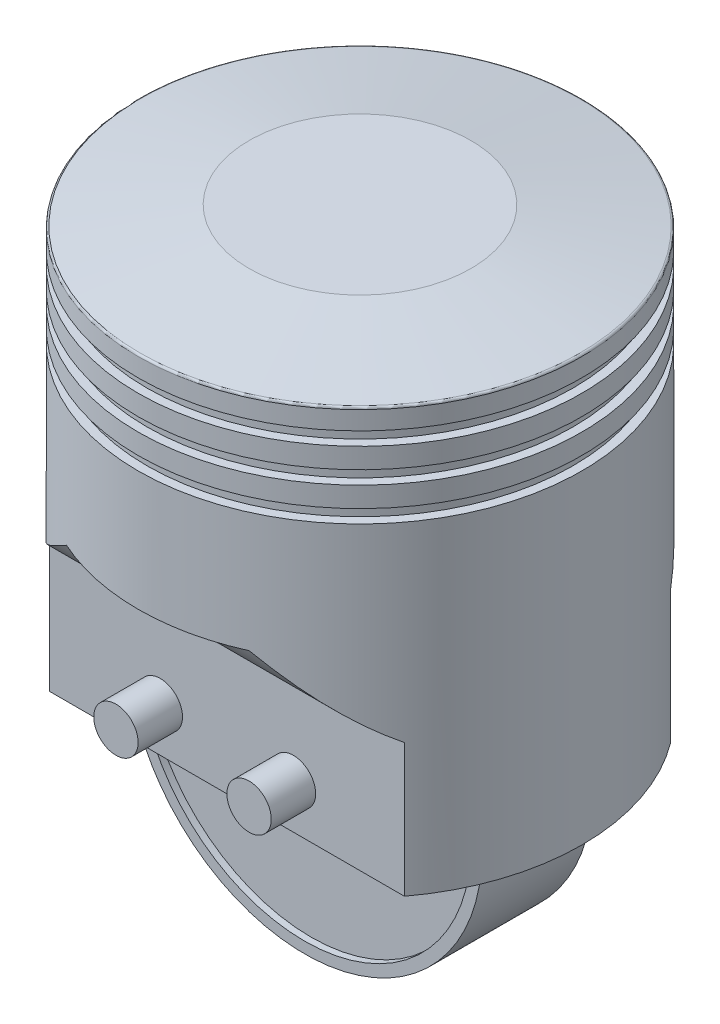
ISO-10303-21;
HEADER;
FILE_DESCRIPTION(('STEP AP214'),'2;1');
FILE_NAME('part.step','',(''),(''),'','','');
FILE_SCHEMA(('AUTOMOTIVE_DESIGN { 1 0 10303 214 1 1 1 1 }'));
ENDSEC;
DATA;
#1=APPLICATION_CONTEXT('core data for automotive mechanical design processes');
#2=APPLICATION_PROTOCOL_DEFINITION('international standard','automotive_design',2000,#1);
#3=PRODUCT_CONTEXT('',#1,'mechanical');
#4=PRODUCT('Part','Part','',(#3));
#5=PRODUCT_RELATED_PRODUCT_CATEGORY('part','',(#4));
#6=PRODUCT_DEFINITION_FORMATION('','',#4);
#7=PRODUCT_DEFINITION_CONTEXT('part definition',#1,'design');
#8=PRODUCT_DEFINITION('design','',#6,#7);
#9=PRODUCT_DEFINITION_SHAPE('','',#8);
#10=(LENGTH_UNIT() NAMED_UNIT(*) SI_UNIT(.MILLI.,.METRE.));
#11=(NAMED_UNIT(*) PLANE_ANGLE_UNIT() SI_UNIT($,.RADIAN.));
#12=(NAMED_UNIT(*) SI_UNIT($,.STERADIAN.) SOLID_ANGLE_UNIT());
#13=UNCERTAINTY_MEASURE_WITH_UNIT(LENGTH_MEASURE(1.E-05),#10,'distance_accuracy_value','');
#14=(GEOMETRIC_REPRESENTATION_CONTEXT(3) GLOBAL_UNCERTAINTY_ASSIGNED_CONTEXT((#13)) GLOBAL_UNIT_ASSIGNED_CONTEXT((#10,
#11,#12)) REPRESENTATION_CONTEXT('',''));
#15=CARTESIAN_POINT('',(0.,0.,0.));
#16=DIRECTION('',(0.,0.,1.));
#17=DIRECTION('',(1.,0.,0.));
#18=AXIS2_PLACEMENT_3D('',#15,#16,#17);
#19=CARTESIAN_POINT('',(0.,0.,-12.5));
#20=DIRECTION('',(0.,0.,1.));
#21=DIRECTION('',(1.,0.,0.));
#22=AXIS2_PLACEMENT_3D('',#19,#20,#21);
#23=CYLINDRICAL_SURFACE('',#22,37.5);
#24=CARTESIAN_POINT('',(0.,0.,-11.));
#25=DIRECTION('',(0.,0.,1.));
#26=DIRECTION('',(1.,0.,0.));
#27=AXIS2_PLACEMENT_3D('',#24,#25,#26);
#28=CIRCLE('',#27,37.5);
#29=CARTESIAN_POINT('',(-37.4165738677394,-2.5,-11.));
#30=VERTEX_POINT('',#29);
#31=CARTESIAN_POINT('',(37.4165738677394,-2.5,-11.));
#32=VERTEX_POINT('',#31);
#33=EDGE_CURVE('E76',#30,#32,#28,.T.);
#34=ORIENTED_EDGE('',*,*,#33,.T.);
#35=DIRECTION('',(0.,0.,1.));
#36=VECTOR('',#35,1.);
#37=CARTESIAN_POINT('',(37.4165738677394,-2.5,-12.5));
#38=LINE('',#37,#36);
#39=CARTESIAN_POINT('',(37.4165738677394,-2.5,-12.5));
#40=VERTEX_POINT('',#39);
#41=EDGE_CURVE('E158',#40,#32,#38,.T.);
#42=ORIENTED_EDGE('',*,*,#41,.F.);
#43=CARTESIAN_POINT('',(0.,0.,-12.5));
#44=DIRECTION('',(0.,0.,1.));
#45=DIRECTION('',(1.,0.,0.));
#46=AXIS2_PLACEMENT_3D('',#43,#44,#45);
#47=CIRCLE('',#46,37.5);
#48=CARTESIAN_POINT('',(-37.4165738677394,-2.5,-12.5));
#49=VERTEX_POINT('',#48);
#50=EDGE_CURVE('E185',#49,#40,#47,.T.);
#51=ORIENTED_EDGE('',*,*,#50,.F.);
#52=DIRECTION('',(0.,0.,1.));
#53=VECTOR('',#52,1.);
#54=CARTESIAN_POINT('',(-37.4165738677394,-2.5,-12.5));
#55=LINE('',#54,#53);
#56=EDGE_CURVE('E157',#49,#30,#55,.T.);
#57=ORIENTED_EDGE('',*,*,#56,.T.);
#58=EDGE_LOOP('',(#34,#42,#51,#57));
#59=FACE_BOUND('',#58,.T.);
#60=ADVANCED_FACE('F62',(#59),#23,.F.);
#61=CARTESIAN_POINT('',(-37.4165738677394,-2.5,-12.5));
#62=DIRECTION('',(0.,-1.,0.));
#63=DIRECTION('',(0.,0.,-1.));
#64=AXIS2_PLACEMENT_3D('',#61,#62,#63);
#65=PLANE('',#64);
#66=ORIENTED_EDGE('',*,*,#41,.T.);
#67=DIRECTION('',(1.,0.,0.));
#68=VECTOR('',#67,1.);
#69=CARTESIAN_POINT('',(-37.4165738677394,-2.5,-11.));
#70=LINE('',#69,#68);
#71=EDGE_CURVE('E165',#30,#32,#70,.T.);
#72=ORIENTED_EDGE('',*,*,#71,.F.);
#73=ORIENTED_EDGE('',*,*,#56,.F.);
#74=DIRECTION('',(1.,0.,0.));
#75=VECTOR('',#74,1.);
#76=CARTESIAN_POINT('',(-37.4165738677394,-2.5,-12.5));
#77=LINE('',#76,#75);
#78=EDGE_CURVE('E188',#49,#40,#77,.T.);
#79=ORIENTED_EDGE('',*,*,#78,.T.);
#80=EDGE_LOOP('',(#66,#72,#73,#79));
#81=FACE_BOUND('',#80,.T.);
#82=ADVANCED_FACE('F348',(#81),#65,.T.);
#83=CARTESIAN_POINT('',(0.,0.,0.));
#84=DIRECTION('',(0.,1.,0.));
#85=DIRECTION('',(0.,0.,1.));
#86=AXIS2_PLACEMENT_3D('',#83,#84,#85);
#87=PLANE('',#86);
#88=CARTESIAN_POINT('',(0.,0.,0.));
#89=DIRECTION('',(0.,1.,0.));
#90=DIRECTION('',(0.,0.,1.));
#91=AXIS2_PLACEMENT_3D('',#88,#89,#90);
#92=CIRCLE('',#91,50.);
#93=CARTESIAN_POINT('',(40.,0.,30.));
#94=VERTEX_POINT('',#93);
#95=CARTESIAN_POINT('',(40.,0.,-30.));
#96=VERTEX_POINT('',#95);
#97=EDGE_CURVE('E230',#94,#96,#92,.T.);
#98=ORIENTED_EDGE('',*,*,#97,.F.);
#99=DIRECTION('',(1.,0.,0.));
#100=VECTOR('',#99,1.);
#101=CARTESIAN_POINT('',(-50.,0.,30.));
#102=LINE('',#101,#100);
#103=CARTESIAN_POINT('',(-40.,0.,30.));
#104=VERTEX_POINT('',#103);
#105=EDGE_CURVE('E209',#104,#94,#102,.T.);
#106=ORIENTED_EDGE('',*,*,#105,.F.);
#107=CARTESIAN_POINT('',(-40.,0.,-30.));
#108=VERTEX_POINT('',#107);
#109=EDGE_CURVE('E227',#108,#104,#92,.T.);
#110=ORIENTED_EDGE('',*,*,#109,.F.);
#111=DIRECTION('',(1.,0.,0.));
#112=VECTOR('',#111,1.);
#113=CARTESIAN_POINT('',(-50.,0.,-30.));
#114=LINE('',#113,#112);
#115=EDGE_CURVE('E202',#108,#96,#114,.T.);
#116=ORIENTED_EDGE('',*,*,#115,.T.);
#117=EDGE_LOOP('',(#98,#106,#110,#116));
#118=FACE_BOUND('',#117,.T.);
#119=DIRECTION('',(1.,0.,0.));
#120=VECTOR('',#119,1.);
#121=CARTESIAN_POINT('',(-40.,0.,-12.5));
#122=LINE('',#121,#120);
#123=CARTESIAN_POINT('',(-40.,0.,-12.5));
#124=VERTEX_POINT('',#123);
#125=CARTESIAN_POINT('',(40.,0.,-12.5));
#126=VERTEX_POINT('',#125);
#127=EDGE_CURVE('E196',#124,#126,#122,.T.);
#128=ORIENTED_EDGE('',*,*,#127,.F.);
#129=DIRECTION('',(0.,0.,1.));
#130=VECTOR('',#129,1.);
#131=CARTESIAN_POINT('',(-40.,0.,-12.5));
#132=LINE('',#131,#130);
#133=CARTESIAN_POINT('',(-40.,0.,12.5));
#134=VERTEX_POINT('',#133);
#135=EDGE_CURVE('E199',#124,#134,#132,.T.);
#136=ORIENTED_EDGE('',*,*,#135,.T.);
#137=DIRECTION('',(1.,0.,0.));
#138=VECTOR('',#137,1.);
#139=CARTESIAN_POINT('',(-40.,0.,12.5));
#140=LINE('',#139,#138);
#141=CARTESIAN_POINT('',(40.,0.,12.5));
#142=VERTEX_POINT('',#141);
#143=EDGE_CURVE('E182',#134,#142,#140,.T.);
#144=ORIENTED_EDGE('',*,*,#143,.T.);
#145=DIRECTION('',(0.,0.,1.));
#146=VECTOR('',#145,1.);
#147=CARTESIAN_POINT('',(40.,0.,-12.5));
#148=LINE('',#147,#146);
#149=EDGE_CURVE('E198',#126,#142,#148,.T.);
#150=ORIENTED_EDGE('',*,*,#149,.F.);
#151=EDGE_LOOP('',(#128,#136,#144,#150));
#152=FACE_BOUND('',#151,.T.);
#153=ADVANCED_FACE('F393',(#118,#152),#87,.F.);
#154=CARTESIAN_POINT('',(0.,95.74,0.));
#155=DIRECTION('',(0.,1.,0.));
#156=DIRECTION('',(0.,0.,1.));
#157=AXIS2_PLACEMENT_3D('',#154,#155,#156);
#158=CYLINDRICAL_SURFACE('',#157,50.);
#159=ORIENTED_EDGE('',*,*,#109,.T.);
#160=DIRECTION('',(0.,1.,0.));
#161=VECTOR('',#160,1.);
#162=CARTESIAN_POINT('',(-40.,95.74,30.));
#163=LINE('',#162,#161);
#164=CARTESIAN_POINT('',(-40.,30.,30.));
#165=VERTEX_POINT('',#164);
#166=EDGE_CURVE('E691',#104,#165,#163,.T.);
#167=ORIENTED_EDGE('',*,*,#166,.T.);
#168=CARTESIAN_POINT('',(-40.,30.,30.));
#169=CARTESIAN_POINT('',(-39.4227032689949,30.4975534975394,30.7696701134222));
#170=CARTESIAN_POINT('',(-38.8280758665105,31.0101840720913,31.5162848137399));
#171=CARTESIAN_POINT('',(-37.6072571229905,32.0613492886964,32.9634784476577));
#172=CARTESIAN_POINT('',(-36.981078392916,32.599873577243,33.6640755204339));
#173=CARTESIAN_POINT('',(-35.7005169530153,33.6983552946373,35.0191516853208));
#174=CARTESIAN_POINT('',(-35.0461669614549,34.2582877795347,35.6736820686269));
#175=CARTESIAN_POINT('',(-33.7107707573544,35.396454228156,36.9381869030231));
#176=CARTESIAN_POINT('',(-33.0297220443191,35.9746899051022,37.5481571653982));
#177=CARTESIAN_POINT('',(-31.6559925614159,37.1345691402128,38.7129641596555));
#178=CARTESIAN_POINT('',(-30.9637813965993,37.7159373527949,39.2686305548842));
#179=CARTESIAN_POINT('',(-29.5566072080388,38.8892481654038,40.3384204088622));
#180=CARTESIAN_POINT('',(-28.8416439271136,39.4811908849277,40.8525433977879));
#181=CARTESIAN_POINT('',(-27.3898803244225,40.6718354566004,41.839751771623));
#182=CARTESIAN_POINT('',(-26.6530867701786,41.2705351791315,42.3128496996117));
#183=CARTESIAN_POINT('',(-25.1576181666023,42.4708742234107,43.2187284102895));
#184=CARTESIAN_POINT('',(-24.3989466769569,43.072513053862,43.6515157038571));
#185=CARTESIAN_POINT('',(-23.3798733469499,43.8677498266828,44.1979794501996));
#186=CARTESIAN_POINT('',(-23.1295196711872,44.0621076531451,44.3295087284819));
#187=CARTESIAN_POINT('',(-22.6264493222155,44.4504360746419,44.5883820555464));
#188=CARTESIAN_POINT('',(-22.3737331496249,44.6444067415986,44.7157269662917));
#189=CARTESIAN_POINT('',(-21.8650471727875,45.0324183037877,44.9666587982457));
#190=CARTESIAN_POINT('',(-21.6090696460871,45.2264575086261,45.0902326700021));
#191=CARTESIAN_POINT('',(-21.0945225142599,45.6138252212219,45.3332334026729));
#192=CARTESIAN_POINT('',(-20.8359523648707,45.8071535675945,45.4526593683017));
#193=CARTESIAN_POINT('',(-20.5760807735584,46.,45.57));
#194=B_SPLINE_CURVE_WITH_KNOTS('',3,(#168,#169,#170,#171,#172,#173,#174,#175,#176,#177,#178,
#179,#180,#181,#182,#183,#184,#185,#186,#187,#188,#189,#190,#191,#192,#193),.UNSPECIFIED.,.F.,
.F.,(4,2,2,2,2,2,2,2,2,2,2,2,4),(0.,3.24865454866567,6.49602076477623,9.73971217259787,
12.9837081007362,16.1658316923563,19.3479912662757,22.5291744649436,25.709842952158,
26.7392718324943,27.7684873079119,28.800933118737,29.8336004054466),.UNSPECIFIED.);
#195=CARTESIAN_POINT('',(-20.5760807735584,46.,45.57));
#196=VERTEX_POINT('',#195);
#197=EDGE_CURVE('E315',#165,#196,#194,.T.);
#198=ORIENTED_EDGE('',*,*,#197,.T.);
#199=CARTESIAN_POINT('',(0.,46.,0.));
#200=DIRECTION('',(0.,1.,0.));
#201=DIRECTION('',(0.,0.,1.));
#202=AXIS2_PLACEMENT_3D('',#199,#200,#201);
#203=CIRCLE('',#202,50.);
#204=CARTESIAN_POINT('',(20.5760807735584,46.,45.57));
#205=VERTEX_POINT('',#204);
#206=EDGE_CURVE('E306',#196,#205,#203,.T.);
#207=ORIENTED_EDGE('',*,*,#206,.T.);
#208=CARTESIAN_POINT('',(20.5760807735584,46.,45.57));
#209=CARTESIAN_POINT('',(20.981784040253,45.6989144606753,45.3868047922138));
#210=CARTESIAN_POINT('',(21.3843295908557,45.396674988717,45.198531029963));
#211=CARTESIAN_POINT('',(22.183314755004,44.790649637896,44.8118037442421));
#212=CARTESIAN_POINT('',(22.5797544249881,44.4868637733618,44.6133503149392));
#213=CARTESIAN_POINT('',(23.3667819328865,43.8784728089327,44.2062184562751));
#214=CARTESIAN_POINT('',(23.7573692153487,43.5738676344726,43.9975390642909));
#215=CARTESIAN_POINT('',(24.5327756890314,42.964524273275,43.5699315233433));
#216=CARTESIAN_POINT('',(24.9175948619762,42.6597860861192,43.3510033419164));
#217=CARTESIAN_POINT('',(26.0657605722335,41.7445125045882,42.6774574997543));
#218=CARTESIAN_POINT('',(26.8205771463097,41.1346561038182,42.2072361006545));
#219=CARTESIAN_POINT('',(28.3074500316953,39.9211891251853,41.2247758593004));
#220=CARTESIAN_POINT('',(29.0395072978727,39.3175782860004,40.7125387831054));
#221=CARTESIAN_POINT('',(30.4638796376346,38.1340907109363,39.6575263273948));
#222=CARTESIAN_POINT('',(31.1567207061469,37.5539868769227,39.1157171393662));
#223=CARTESIAN_POINT('',(32.5191898661321,36.4067448258019,37.9905628434812));
#224=CARTESIAN_POINT('',(33.1888163459033,35.8396075098385,37.4072148602942));
#225=CARTESIAN_POINT('',(34.5022607121716,34.7225940370902,36.1992936055282));
#226=CARTESIAN_POINT('',(35.1461167971835,34.1726926161163,35.574785279314));
#227=CARTESIAN_POINT('',(36.4070455086904,33.0927699150074,34.2832490773174));
#228=CARTESIAN_POINT('',(37.0241253362605,32.5627432951151,33.6162327540551));
#229=CARTESIAN_POINT('',(37.8310058369131,31.8686291724948,32.6942093961392));
#230=CARTESIAN_POINT('',(38.0337293737554,31.6941439259334,32.4581688983703));
#231=CARTESIAN_POINT('',(38.4357168337174,31.3480169315365,31.9811343002584));
#232=CARTESIAN_POINT('',(38.63498100088,31.1763749831584,31.7401405519861));
#233=CARTESIAN_POINT('',(39.0307114624784,30.8354186902669,31.2522416515386));
#234=CARTESIAN_POINT('',(39.2271639925751,30.6661158839892,31.0053172761714));
#235=CARTESIAN_POINT('',(39.6163815654185,30.3306561591055,30.5064322018367));
#236=CARTESIAN_POINT('',(39.8091462859388,30.164499515412,30.2544710666745));
#237=CARTESIAN_POINT('',(40.,30.,30.));
#238=B_SPLINE_CURVE_WITH_KNOTS('',3,(#208,#209,#210,#211,#212,#213,#214,#215,#216,#217,#218,
#219,#220,#221,#222,#223,#224,#225,#226,#227,#228,#229,#230,#231,#232,#233,#234,#235,#236,#237),
.UNSPECIFIED.,.F.,.F.,(4,2,2,2,2,2,2,2,2,2,2,2,2,2,4),(0.,1.61218211852802,3.22434932622676,
4.83666858822806,6.44899295765845,9.68281694015645,12.9165050638105,16.0762470331502,
19.236207933993,22.3912969899199,25.5455322050653,26.615682814609,27.6857576204987,
28.7599618277761,29.8342594700834),.UNSPECIFIED.);
#239=CARTESIAN_POINT('',(40.,30.,30.));
#240=VERTEX_POINT('',#239);
#241=EDGE_CURVE('E308',#205,#240,#238,.T.);
#242=ORIENTED_EDGE('',*,*,#241,.T.);
#243=DIRECTION('',(0.,1.,0.));
#244=VECTOR('',#243,1.);
#245=CARTESIAN_POINT('',(40.,95.74,30.));
#246=LINE('',#245,#244);
#247=EDGE_CURVE('E689',#240,#94,#246,.F.);
#248=ORIENTED_EDGE('',*,*,#247,.T.);
#249=ORIENTED_EDGE('',*,*,#97,.T.);
#250=DIRECTION('',(0.,1.,0.));
#251=VECTOR('',#250,1.);
#252=CARTESIAN_POINT('',(40.,95.74,-30.));
#253=LINE('',#252,#251);
#254=CARTESIAN_POINT('',(40.,30.,-30.));
#255=VERTEX_POINT('',#254);
#256=EDGE_CURVE('E304',#255,#96,#253,.F.);
#257=ORIENTED_EDGE('',*,*,#256,.F.);
#258=CARTESIAN_POINT('',(20.5760807735584,46.,-45.57));
#259=CARTESIAN_POINT('',(20.981784040253,45.6989144606753,-45.3868047922138));
#260=CARTESIAN_POINT('',(21.3843295908557,45.396674988717,-45.198531029963));
#261=CARTESIAN_POINT('',(22.183314755004,44.790649637896,-44.8118037442421));
#262=CARTESIAN_POINT('',(22.5797544249881,44.4868637733618,-44.6133503149392));
#263=CARTESIAN_POINT('',(23.3667819328865,43.8784728089326,-44.2062184562751));
#264=CARTESIAN_POINT('',(23.7573692153487,43.5738676344725,-43.9975390642909));
#265=CARTESIAN_POINT('',(24.5327756890314,42.9645242732749,-43.5699315233433));
#266=CARTESIAN_POINT('',(24.9175948619762,42.6597860861192,-43.3510033419164));
#267=CARTESIAN_POINT('',(26.0657605722335,41.7445125045882,-42.6774574997543));
#268=CARTESIAN_POINT('',(26.8205771463097,41.1346561038181,-42.2072361006545));
#269=CARTESIAN_POINT('',(28.3074500316953,39.9211891251853,-41.2247758593004));
#270=CARTESIAN_POINT('',(29.0395072978727,39.3175782860004,-40.7125387831054));
#271=CARTESIAN_POINT('',(30.4638796376346,38.1340907109363,-39.6575263273948));
#272=CARTESIAN_POINT('',(31.1567207061469,37.5539868769227,-39.1157171393662));
#273=CARTESIAN_POINT('',(32.5191898661322,36.4067448258019,-37.9905628434812));
#274=CARTESIAN_POINT('',(33.1888163459033,35.8396075098385,-37.4072148602942));
#275=CARTESIAN_POINT('',(34.5022607121716,34.7225940370902,-36.1992936055282));
#276=CARTESIAN_POINT('',(35.1461167971835,34.1726926161163,-35.574785279314));
#277=CARTESIAN_POINT('',(36.4070455086904,33.0927699150074,-34.2832490773173));
#278=CARTESIAN_POINT('',(37.0241253362605,32.5627432951151,-33.6162327540551));
#279=CARTESIAN_POINT('',(37.8310058369131,31.8686291724948,-32.6942093961392));
#280=CARTESIAN_POINT('',(38.0337293737554,31.6941439259334,-32.4581688983703));
#281=CARTESIAN_POINT('',(38.4357168337174,31.3480169315365,-31.9811343002584));
#282=CARTESIAN_POINT('',(38.63498100088,31.1763749831584,-31.7401405519861));
#283=CARTESIAN_POINT('',(39.0307114624784,30.8354186902669,-31.2522416515386));
#284=CARTESIAN_POINT('',(39.2271639925751,30.6661158839891,-31.0053172761713));
#285=CARTESIAN_POINT('',(39.6163815654186,30.3306561591055,-30.5064322018367));
#286=CARTESIAN_POINT('',(39.8091462859388,30.164499515412,-30.2544710666745));
#287=CARTESIAN_POINT('',(40.,30.,-30.));
#288=B_SPLINE_CURVE_WITH_KNOTS('',3,(#258,#259,#260,#261,#262,#263,#264,#265,#266,#267,#268,
#269,#270,#271,#272,#273,#274,#275,#276,#277,#278,#279,#280,#281,#282,#283,#284,#285,#286,#287),
.UNSPECIFIED.,.F.,.F.,(4,2,2,2,2,2,2,2,2,2,2,2,2,2,4),(0.,1.61218211852802,3.22434932622676,
4.83666858822805,6.44899295765844,9.68281694015645,12.9165050638105,16.0762470331502,
19.236207933993,22.3912969899199,25.5455322050652,26.615682814609,27.6857576204987,
28.7599618277761,29.8342594700834),.UNSPECIFIED.);
#289=CARTESIAN_POINT('',(20.5760807735584,46.,-45.57));
#290=VERTEX_POINT('',#289);
#291=EDGE_CURVE('E298',#290,#255,#288,.T.);
#292=ORIENTED_EDGE('',*,*,#291,.F.);
#293=CARTESIAN_POINT('',(0.,46.,0.));
#294=DIRECTION('',(0.,-1.,0.));
#295=DIRECTION('',(0.,0.,-1.));
#296=AXIS2_PLACEMENT_3D('',#293,#294,#295);
#297=CIRCLE('',#296,50.);
#298=CARTESIAN_POINT('',(-20.5760807735584,46.,-45.57));
#299=VERTEX_POINT('',#298);
#300=EDGE_CURVE('E270',#299,#290,#297,.T.);
#301=ORIENTED_EDGE('',*,*,#300,.F.);
#302=CARTESIAN_POINT('',(-40.,30.,-30.));
#303=CARTESIAN_POINT('',(-39.4227032689949,30.4975534975394,-30.7696701134222));
#304=CARTESIAN_POINT('',(-38.8280758665105,31.0101840720912,-31.5162848137399));
#305=CARTESIAN_POINT('',(-37.6072571229905,32.0613492886964,-32.9634784476577));
#306=CARTESIAN_POINT('',(-36.981078392916,32.5998735772429,-33.6640755204339));
#307=CARTESIAN_POINT('',(-35.7005169530153,33.6983552946373,-35.0191516853208));
#308=CARTESIAN_POINT('',(-35.0461669614549,34.2582877795346,-35.6736820686269));
#309=CARTESIAN_POINT('',(-33.7107707573544,35.3964542281559,-36.9381869030231));
#310=CARTESIAN_POINT('',(-33.0297220443191,35.9746899051022,-37.5481571653982));
#311=CARTESIAN_POINT('',(-31.6559925614159,37.1345691402128,-38.7129641596555));
#312=CARTESIAN_POINT('',(-30.9637813965993,37.7159373527949,-39.2686305548842));
#313=CARTESIAN_POINT('',(-29.5566072080388,38.8892481654038,-40.3384204088622));
#314=CARTESIAN_POINT('',(-28.8416439271136,39.4811908849276,-40.8525433977879));
#315=CARTESIAN_POINT('',(-27.3898803244226,40.6718354566004,-41.8397517716229));
#316=CARTESIAN_POINT('',(-26.6530867701786,41.2705351791315,-42.3128496996117));
#317=CARTESIAN_POINT('',(-25.1576181666023,42.4708742234107,-43.2187284102895));
#318=CARTESIAN_POINT('',(-24.3989466769569,43.072513053862,-43.6515157038571));
#319=CARTESIAN_POINT('',(-23.3798733469499,43.8677498266827,-44.1979794501996));
#320=CARTESIAN_POINT('',(-23.1295196711872,44.0621076531451,-44.3295087284819));
#321=CARTESIAN_POINT('',(-22.6264493222156,44.4504360746419,-44.5883820555463));
#322=CARTESIAN_POINT('',(-22.3737331496249,44.6444067415986,-44.7157269662916));
#323=CARTESIAN_POINT('',(-21.8650471727875,45.0324183037877,-44.9666587982457));
#324=CARTESIAN_POINT('',(-21.6090696460871,45.2264575086261,-45.0902326700021));
#325=CARTESIAN_POINT('',(-21.0945225142599,45.6138252212219,-45.3332334026729));
#326=CARTESIAN_POINT('',(-20.8359523648707,45.8071535675945,-45.4526593683017));
#327=CARTESIAN_POINT('',(-20.5760807735584,46.,-45.57));
#328=B_SPLINE_CURVE_WITH_KNOTS('',3,(#302,#303,#304,#305,#306,#307,#308,#309,#310,#311,#312,
#313,#314,#315,#316,#317,#318,#319,#320,#321,#322,#323,#324,#325,#326,#327),.UNSPECIFIED.,.F.,
.F.,(4,2,2,2,2,2,2,2,2,2,2,2,4),(0.,3.24865454866567,6.49602076477623,9.73971217259787,
12.9837081007362,16.1658316923563,19.3479912662757,22.5291744649436,25.709842952158,
26.7392718324943,27.7684873079119,28.800933118737,29.8336004054466),.UNSPECIFIED.);
#329=CARTESIAN_POINT('',(-40.,30.,-30.));
#330=VERTEX_POINT('',#329);
#331=EDGE_CURVE('E272',#330,#299,#328,.T.);
#332=ORIENTED_EDGE('',*,*,#331,.F.);
#333=DIRECTION('',(0.,1.,0.));
#334=VECTOR('',#333,1.);
#335=CARTESIAN_POINT('',(-40.,95.74,-30.));
#336=LINE('',#335,#334);
#337=EDGE_CURVE('E281',#108,#330,#336,.T.);
#338=ORIENTED_EDGE('',*,*,#337,.F.);
#339=EDGE_LOOP('',(#159,#167,#198,#207,#242,#248,#249,#257,#292,#301,#332,#338));
#340=FACE_BOUND('',#339,.T.);
#341=CARTESIAN_POINT('',(0.,73.,0.));
#342=DIRECTION('',(0.,1.,0.));
#343=DIRECTION('',(0.,0.,1.));
#344=AXIS2_PLACEMENT_3D('',#341,#342,#343);
#345=CIRCLE('',#344,50.);
#346=CARTESIAN_POINT('',(0.,73.,50.));
#347=VERTEX_POINT('',#346);
#348=EDGE_CURVE('E231',#347,#347,#345,.T.);
#349=ORIENTED_EDGE('',*,*,#348,.F.);
#350=EDGE_LOOP('',(#349));
#351=FACE_BOUND('',#350,.T.);
#352=ADVANCED_FACE('F283',(#340,#351),#158,.T.);
#353=CARTESIAN_POINT('',(0.,73.,0.));
#354=DIRECTION('',(0.,-1.,0.));
#355=DIRECTION('',(0.,0.,-1.));
#356=AXIS2_PLACEMENT_3D('',#353,#354,#355);
#357=PLANE('',#356);
#358=CARTESIAN_POINT('',(0.,73.,0.));
#359=DIRECTION('',(0.,1.,0.));
#360=DIRECTION('',(0.,0.,1.));
#361=AXIS2_PLACEMENT_3D('',#358,#359,#360);
#362=CIRCLE('',#361,48.);
#363=CARTESIAN_POINT('',(0.,73.,48.));
#364=VERTEX_POINT('',#363);
#365=EDGE_CURVE('E234',#364,#364,#362,.T.);
#366=ORIENTED_EDGE('',*,*,#365,.F.);
#367=EDGE_LOOP('',(#366));
#368=FACE_BOUND('',#367,.T.);
#369=ORIENTED_EDGE('',*,*,#348,.T.);
#370=EDGE_LOOP('',(#369));
#371=FACE_BOUND('',#370,.T.);
#372=ADVANCED_FACE('F410',(#368,#371),#357,.F.);
#373=CARTESIAN_POINT('',(0.,95.74,0.));
#374=DIRECTION('',(0.,1.,0.));
#375=DIRECTION('',(0.,0.,1.));
#376=AXIS2_PLACEMENT_3D('',#373,#374,#375);
#377=CYLINDRICAL_SURFACE('',#376,48.);
#378=CARTESIAN_POINT('',(0.,76.,0.));
#379=DIRECTION('',(0.,1.,0.));
#380=DIRECTION('',(0.,0.,1.));
#381=AXIS2_PLACEMENT_3D('',#378,#379,#380);
#382=CIRCLE('',#381,48.);
#383=CARTESIAN_POINT('',(0.,76.,48.));
#384=VERTEX_POINT('',#383);
#385=EDGE_CURVE('E237',#384,#384,#382,.T.);
#386=ORIENTED_EDGE('',*,*,#385,.F.);
#387=EDGE_LOOP('',(#386));
#388=FACE_BOUND('',#387,.T.);
#389=ORIENTED_EDGE('',*,*,#365,.T.);
#390=EDGE_LOOP('',(#389));
#391=FACE_BOUND('',#390,.T.);
#392=ADVANCED_FACE('F436',(#388,#391),#377,.T.);
#393=CARTESIAN_POINT('',(0.,76.,0.));
#394=DIRECTION('',(0.,-1.,0.));
#395=DIRECTION('',(0.,0.,-1.));
#396=AXIS2_PLACEMENT_3D('',#393,#394,#395);
#397=PLANE('',#396);
#398=ORIENTED_EDGE('',*,*,#385,.T.);
#399=EDGE_LOOP('',(#398));
#400=FACE_BOUND('',#399,.T.);
#401=CARTESIAN_POINT('',(0.,76.,0.));
#402=DIRECTION('',(0.,1.,0.));
#403=DIRECTION('',(0.,0.,1.));
#404=AXIS2_PLACEMENT_3D('',#401,#402,#403);
#405=CIRCLE('',#404,50.);
#406=CARTESIAN_POINT('',(0.,76.,50.));
#407=VERTEX_POINT('',#406);
#408=EDGE_CURVE('E240',#407,#407,#405,.T.);
#409=ORIENTED_EDGE('',*,*,#408,.F.);
#410=EDGE_LOOP('',(#409));
#411=FACE_BOUND('',#410,.T.);
#412=ADVANCED_FACE('F441',(#400,#411),#397,.T.);
#413=CARTESIAN_POINT('',(0.,95.74,0.));
#414=DIRECTION('',(0.,1.,0.));
#415=DIRECTION('',(0.,0.,1.));
#416=AXIS2_PLACEMENT_3D('',#413,#414,#415);
#417=CYLINDRICAL_SURFACE('',#416,50.);
#418=CARTESIAN_POINT('',(0.,80.58,0.));
#419=DIRECTION('',(0.,1.,0.));
#420=DIRECTION('',(0.,0.,1.));
#421=AXIS2_PLACEMENT_3D('',#418,#419,#420);
#422=CIRCLE('',#421,50.);
#423=CARTESIAN_POINT('',(0.,80.58,50.));
#424=VERTEX_POINT('',#423);
#425=EDGE_CURVE('E243',#424,#424,#422,.T.);
#426=ORIENTED_EDGE('',*,*,#425,.F.);
#427=EDGE_LOOP('',(#426));
#428=FACE_BOUND('',#427,.T.);
#429=ORIENTED_EDGE('',*,*,#408,.T.);
#430=EDGE_LOOP('',(#429));
#431=FACE_BOUND('',#430,.T.);
#432=ADVANCED_FACE('F449',(#428,#431),#417,.T.);
#433=CARTESIAN_POINT('',(0.,80.58,0.));
#434=DIRECTION('',(0.,-1.,0.));
#435=DIRECTION('',(0.,0.,-1.));
#436=AXIS2_PLACEMENT_3D('',#433,#434,#435);
#437=PLANE('',#436);
#438=CARTESIAN_POINT('',(0.,80.58,0.));
#439=DIRECTION('',(0.,1.,0.));
#440=DIRECTION('',(0.,0.,1.));
#441=AXIS2_PLACEMENT_3D('',#438,#439,#440);
#442=CIRCLE('',#441,48.);
#443=CARTESIAN_POINT('',(0.,80.58,48.));
#444=VERTEX_POINT('',#443);
#445=EDGE_CURVE('E246',#444,#444,#442,.T.);
#446=ORIENTED_EDGE('',*,*,#445,.F.);
#447=EDGE_LOOP('',(#446));
#448=FACE_BOUND('',#447,.T.);
#449=ORIENTED_EDGE('',*,*,#425,.T.);
#450=EDGE_LOOP('',(#449));
#451=FACE_BOUND('',#450,.T.);
#452=ADVANCED_FACE('F453',(#448,#451),#437,.F.);
#453=CARTESIAN_POINT('',(0.,95.74,0.));
#454=DIRECTION('',(0.,1.,0.));
#455=DIRECTION('',(0.,0.,1.));
#456=AXIS2_PLACEMENT_3D('',#453,#454,#455);
#457=CYLINDRICAL_SURFACE('',#456,48.);
#458=CARTESIAN_POINT('',(0.,83.58,0.));
#459=DIRECTION('',(0.,1.,0.));
#460=DIRECTION('',(0.,0.,1.));
#461=AXIS2_PLACEMENT_3D('',#458,#459,#460);
#462=CIRCLE('',#461,48.);
#463=CARTESIAN_POINT('',(0.,83.58,48.));
#464=VERTEX_POINT('',#463);
#465=EDGE_CURVE('E249',#464,#464,#462,.T.);
#466=ORIENTED_EDGE('',*,*,#465,.F.);
#467=EDGE_LOOP('',(#466));
#468=FACE_BOUND('',#467,.T.);
#469=ORIENTED_EDGE('',*,*,#445,.T.);
#470=EDGE_LOOP('',(#469));
#471=FACE_BOUND('',#470,.T.);
#472=ADVANCED_FACE('F457',(#468,#471),#457,.T.);
#473=CARTESIAN_POINT('',(0.,83.58,0.));
#474=DIRECTION('',(0.,1.,0.));
#475=DIRECTION('',(0.,0.,1.));
#476=AXIS2_PLACEMENT_3D('',#473,#474,#475);
#477=PLANE('',#476);
#478=CARTESIAN_POINT('',(0.,83.58,0.));
#479=DIRECTION('',(0.,1.,0.));
#480=DIRECTION('',(0.,0.,1.));
#481=AXIS2_PLACEMENT_3D('',#478,#479,#480);
#482=CIRCLE('',#481,50.);
#483=CARTESIAN_POINT('',(0.,83.58,50.));
#484=VERTEX_POINT('',#483);
#485=EDGE_CURVE('E252',#484,#484,#482,.T.);
#486=ORIENTED_EDGE('',*,*,#485,.F.);
#487=EDGE_LOOP('',(#486));
#488=FACE_BOUND('',#487,.T.);
#489=ORIENTED_EDGE('',*,*,#465,.T.);
#490=EDGE_LOOP('',(#489));
#491=FACE_BOUND('',#490,.T.);
#492=ADVANCED_FACE('F461',(#488,#491),#477,.F.);
#493=CARTESIAN_POINT('',(0.,95.74,0.));
#494=DIRECTION('',(0.,1.,0.));
#495=DIRECTION('',(0.,0.,1.));
#496=AXIS2_PLACEMENT_3D('',#493,#494,#495);
#497=CYLINDRICAL_SURFACE('',#496,50.);
#498=CARTESIAN_POINT('',(0.,88.16,0.));
#499=DIRECTION('',(0.,1.,0.));
#500=DIRECTION('',(0.,0.,1.));
#501=AXIS2_PLACEMENT_3D('',#498,#499,#500);
#502=CIRCLE('',#501,50.);
#503=CARTESIAN_POINT('',(0.,88.16,50.));
#504=VERTEX_POINT('',#503);
#505=EDGE_CURVE('E255',#504,#504,#502,.T.);
#506=ORIENTED_EDGE('',*,*,#505,.F.);
#507=EDGE_LOOP('',(#506));
#508=FACE_BOUND('',#507,.T.);
#509=ORIENTED_EDGE('',*,*,#485,.T.);
#510=EDGE_LOOP('',(#509));
#511=FACE_BOUND('',#510,.T.);
#512=ADVANCED_FACE('F465',(#508,#511),#497,.T.);
#513=CARTESIAN_POINT('',(0.,88.16,0.));
#514=DIRECTION('',(0.,-1.,0.));
#515=DIRECTION('',(0.,0.,-1.));
#516=AXIS2_PLACEMENT_3D('',#513,#514,#515);
#517=PLANE('',#516);
#518=CARTESIAN_POINT('',(0.,88.16,0.));
#519=DIRECTION('',(0.,1.,0.));
#520=DIRECTION('',(0.,0.,1.));
#521=AXIS2_PLACEMENT_3D('',#518,#519,#520);
#522=CIRCLE('',#521,48.);
#523=CARTESIAN_POINT('',(0.,88.16,48.));
#524=VERTEX_POINT('',#523);
#525=EDGE_CURVE('E258',#524,#524,#522,.T.);
#526=ORIENTED_EDGE('',*,*,#525,.F.);
#527=EDGE_LOOP('',(#526));
#528=FACE_BOUND('',#527,.T.);
#529=ORIENTED_EDGE('',*,*,#505,.T.);
#530=EDGE_LOOP('',(#529));
#531=FACE_BOUND('',#530,.T.);
#532=ADVANCED_FACE('F469',(#528,#531),#517,.F.);
#533=CARTESIAN_POINT('',(0.,95.74,0.));
#534=DIRECTION('',(0.,1.,0.));
#535=DIRECTION('',(0.,0.,1.));
#536=AXIS2_PLACEMENT_3D('',#533,#534,#535);
#537=CYLINDRICAL_SURFACE('',#536,48.);
#538=CARTESIAN_POINT('',(0.,91.16,0.));
#539=DIRECTION('',(0.,1.,0.));
#540=DIRECTION('',(0.,0.,1.));
#541=AXIS2_PLACEMENT_3D('',#538,#539,#540);
#542=CIRCLE('',#541,48.);
#543=CARTESIAN_POINT('',(0.,91.16,48.));
#544=VERTEX_POINT('',#543);
#545=EDGE_CURVE('E261',#544,#544,#542,.T.);
#546=ORIENTED_EDGE('',*,*,#545,.F.);
#547=EDGE_LOOP('',(#546));
#548=FACE_BOUND('',#547,.T.);
#549=ORIENTED_EDGE('',*,*,#525,.T.);
#550=EDGE_LOOP('',(#549));
#551=FACE_BOUND('',#550,.T.);
#552=ADVANCED_FACE('F473',(#548,#551),#537,.T.);
#553=CARTESIAN_POINT('',(0.,91.16,0.));
#554=DIRECTION('',(0.,1.,0.));
#555=DIRECTION('',(0.,0.,1.));
#556=AXIS2_PLACEMENT_3D('',#553,#554,#555);
#557=PLANE('',#556);
#558=CARTESIAN_POINT('',(0.,91.16,0.));
#559=DIRECTION('',(0.,1.,0.));
#560=DIRECTION('',(0.,0.,1.));
#561=AXIS2_PLACEMENT_3D('',#558,#559,#560);
#562=CIRCLE('',#561,50.);
#563=CARTESIAN_POINT('',(0.,91.16,50.));
#564=VERTEX_POINT('',#563);
#565=EDGE_CURVE('E264',#564,#564,#562,.T.);
#566=ORIENTED_EDGE('',*,*,#565,.F.);
#567=EDGE_LOOP('',(#566));
#568=FACE_BOUND('',#567,.T.);
#569=ORIENTED_EDGE('',*,*,#545,.T.);
#570=EDGE_LOOP('',(#569));
#571=FACE_BOUND('',#570,.T.);
#572=ADVANCED_FACE('F424',(#568,#571),#557,.F.);
#573=CARTESIAN_POINT('',(0.,95.74,0.));
#574=DIRECTION('',(0.,1.,0.));
#575=DIRECTION('',(0.,0.,1.));
#576=AXIS2_PLACEMENT_3D('',#573,#574,#575);
#577=CYLINDRICAL_SURFACE('',#576,50.);
#578=CARTESIAN_POINT('',(0.,95.3178264596807,0.));
#579=DIRECTION('',(0.,1.,0.));
#580=DIRECTION('',(0.,0.,1.));
#581=AXIS2_PLACEMENT_3D('',#578,#579,#580);
#582=CIRCLE('',#581,50.);
#583=CARTESIAN_POINT('',(0.,95.3178264596807,50.));
#584=VERTEX_POINT('',#583);
#585=EDGE_CURVE('E267',#584,#584,#582,.T.);
#586=ORIENTED_EDGE('',*,*,#585,.F.);
#587=EDGE_LOOP('',(#586));
#588=FACE_BOUND('',#587,.T.);
#589=ORIENTED_EDGE('',*,*,#565,.T.);
#590=EDGE_LOOP('',(#589));
#591=FACE_BOUND('',#590,.T.);
#592=ADVANCED_FACE('F419',(#588,#591),#577,.T.);
#593=CARTESIAN_POINT('',(0.,99.99,0.));
#594=DIRECTION('',(0.,-1.,0.));
#595=DIRECTION('',(0.,0.,-1.));
#596=AXIS2_PLACEMENT_3D('',#593,#594,#595);
#597=CONICAL_SURFACE('',#596,25.,1.40240616964737);
#598=CARTESIAN_POINT('',(0.,95.8107543830156,0.));
#599=DIRECTION('',(0.,1.,0.));
#600=DIRECTION('',(0.,0.,1.));
#601=AXIS2_PLACEMENT_3D('',#598,#599,#600);
#602=CIRCLE('',#601,49.5837977469669);
#603=CARTESIAN_POINT('',(0.,95.8107543830156,49.5837977469669));
#604=VERTEX_POINT('',#603);
#605=EDGE_CURVE('E208',#604,#604,#602,.T.);
#606=ORIENTED_EDGE('',*,*,#605,.T.);
#607=EDGE_LOOP('',(#606));
#608=FACE_BOUND('',#607,.T.);
#609=CARTESIAN_POINT('',(0.,99.99,0.));
#610=DIRECTION('',(0.,1.,0.));
#611=DIRECTION('',(0.,0.,1.));
#612=AXIS2_PLACEMENT_3D('',#609,#610,#611);
#613=CIRCLE('',#612,25.);
#614=CARTESIAN_POINT('',(0.,99.99,25.));
#615=VERTEX_POINT('',#614);
#616=EDGE_CURVE('E224',#615,#615,#613,.T.);
#617=ORIENTED_EDGE('',*,*,#616,.F.);
#618=EDGE_LOOP('',(#617));
#619=FACE_BOUND('',#618,.T.);
#620=ADVANCED_FACE('F416',(#608,#619),#597,.T.);
#621=CARTESIAN_POINT('',(0.,99.99,0.));
#622=DIRECTION('',(0.,1.,0.));
#623=DIRECTION('',(0.,0.,1.));
#624=AXIS2_PLACEMENT_3D('',#621,#622,#623);
#625=PLANE('',#624);
#626=ORIENTED_EDGE('',*,*,#616,.T.);
#627=EDGE_LOOP('',(#626));
#628=FACE_BOUND('',#627,.T.);
#629=ADVANCED_FACE('F412',(#628),#625,.T.);
#630=CARTESIAN_POINT('',(0.,95.3178264596807,0.));
#631=DIRECTION('',(0.,1.,0.));
#632=DIRECTION('',(0.,0.,1.));
#633=AXIS2_PLACEMENT_3D('',#630,#631,#632);
#634=TOROIDAL_SURFACE('',#633,49.5,0.500000000000002);
#635=ORIENTED_EDGE('',*,*,#605,.F.);
#636=EDGE_LOOP('',(#635));
#637=FACE_BOUND('',#636,.T.);
#638=ORIENTED_EDGE('',*,*,#585,.T.);
#639=EDGE_LOOP('',(#638));
#640=FACE_BOUND('',#639,.T.);
#641=ADVANCED_FACE('F64',(#637,#640),#634,.T.);
#642=CARTESIAN_POINT('',(-50.,0.,-30.));
#643=DIRECTION('',(0.,0.,-1.));
#644=DIRECTION('',(-1.,0.,0.));
#645=AXIS2_PLACEMENT_3D('',#642,#643,#644);
#646=PLANE('',#645);
#647=CARTESIAN_POINT('',(15.,10.,-30.));
#648=DIRECTION('',(0.,0.,-1.));
#649=DIRECTION('',(-1.,0.,0.));
#650=AXIS2_PLACEMENT_3D('',#647,#648,#649);
#651=CIRCLE('',#650,5.);
#652=CARTESIAN_POINT('',(10.,10.,-30.));
#653=VERTEX_POINT('',#652);
#654=EDGE_CURVE('E711',#653,#653,#651,.F.);
#655=ORIENTED_EDGE('',*,*,#654,.T.);
#656=EDGE_LOOP('',(#655));
#657=FACE_BOUND('',#656,.T.);
#658=CARTESIAN_POINT('',(-15.,10.,-30.));
#659=DIRECTION('',(0.,0.,-1.));
#660=DIRECTION('',(-1.,0.,0.));
#661=AXIS2_PLACEMENT_3D('',#658,#659,#660);
#662=CIRCLE('',#661,5.);
#663=CARTESIAN_POINT('',(-20.,10.,-30.));
#664=VERTEX_POINT('',#663);
#665=EDGE_CURVE('E70',#664,#664,#662,.T.);
#666=ORIENTED_EDGE('',*,*,#665,.F.);
#667=EDGE_LOOP('',(#666));
#668=FACE_BOUND('',#667,.T.);
#669=ORIENTED_EDGE('',*,*,#337,.T.);
#670=DIRECTION('',(1.,0.,0.));
#671=VECTOR('',#670,1.);
#672=CARTESIAN_POINT('',(-50.,30.,-30.));
#673=LINE('',#672,#671);
#674=EDGE_CURVE('E217',#330,#255,#673,.T.);
#675=ORIENTED_EDGE('',*,*,#674,.T.);
#676=ORIENTED_EDGE('',*,*,#256,.T.);
#677=ORIENTED_EDGE('',*,*,#115,.F.);
#678=EDGE_LOOP('',(#669,#675,#676,#677));
#679=FACE_BOUND('',#678,.T.);
#680=ADVANCED_FACE('F293',(#657,#668,#679),#646,.T.);
#681=CARTESIAN_POINT('',(-50.,71.9904218338866,-2.85585746036061));
#682=DIRECTION('',(1.,0.,0.));
#683=DIRECTION('',(0.,0.,-1.));
#684=AXIS2_PLACEMENT_3D('',#681,#682,#683);
#685=CYLINDRICAL_SURFACE('',#684,50.);
#686=ORIENTED_EDGE('',*,*,#291,.T.);
#687=ORIENTED_EDGE('',*,*,#674,.F.);
#688=ORIENTED_EDGE('',*,*,#331,.T.);
#689=DIRECTION('',(1.,0.,0.));
#690=VECTOR('',#689,1.);
#691=CARTESIAN_POINT('',(-50.,46.,-45.57));
#692=LINE('',#691,#690);
#693=EDGE_CURVE('E214',#299,#290,#692,.T.);
#694=ORIENTED_EDGE('',*,*,#693,.T.);
#695=EDGE_LOOP('',(#686,#687,#688,#694));
#696=FACE_BOUND('',#695,.T.);
#697=ADVANCED_FACE('F287',(#696),#685,.T.);
#698=CARTESIAN_POINT('',(-50.,46.,-45.57));
#699=DIRECTION('',(0.,-1.,0.));
#700=DIRECTION('',(0.,0.,-1.));
#701=AXIS2_PLACEMENT_3D('',#698,#699,#700);
#702=PLANE('',#701);
#703=ORIENTED_EDGE('',*,*,#300,.T.);
#704=ORIENTED_EDGE('',*,*,#693,.F.);
#705=EDGE_LOOP('',(#703,#704));
#706=FACE_BOUND('',#705,.T.);
#707=ADVANCED_FACE('F292',(#706),#702,.T.);
#708=CARTESIAN_POINT('',(-50.,71.9904218338866,2.85585746036061));
#709=DIRECTION('',(1.,0.,0.));
#710=DIRECTION('',(0.,0.,-1.));
#711=AXIS2_PLACEMENT_3D('',#708,#709,#710);
#712=CYLINDRICAL_SURFACE('',#711,50.);
#713=DIRECTION('',(1.,0.,0.));
#714=VECTOR('',#713,1.);
#715=CARTESIAN_POINT('',(-50.,30.,30.));
#716=LINE('',#715,#714);
#717=EDGE_CURVE('E205',#165,#240,#716,.T.);
#718=ORIENTED_EDGE('',*,*,#717,.T.);
#719=ORIENTED_EDGE('',*,*,#241,.F.);
#720=DIRECTION('',(1.,0.,0.));
#721=VECTOR('',#720,1.);
#722=CARTESIAN_POINT('',(-50.,46.,45.57));
#723=LINE('',#722,#721);
#724=EDGE_CURVE('E211',#196,#205,#723,.T.);
#725=ORIENTED_EDGE('',*,*,#724,.F.);
#726=ORIENTED_EDGE('',*,*,#197,.F.);
#727=EDGE_LOOP('',(#718,#719,#725,#726));
#728=FACE_BOUND('',#727,.T.);
#729=ADVANCED_FACE('F321',(#728),#712,.T.);
#730=CARTESIAN_POINT('',(-50.,0.,30.));
#731=DIRECTION('',(0.,0.,-1.));
#732=DIRECTION('',(-1.,0.,0.));
#733=AXIS2_PLACEMENT_3D('',#730,#731,#732);
#734=PLANE('',#733);
#735=CARTESIAN_POINT('',(15.,10.,30.));
#736=DIRECTION('',(0.,0.,-1.));
#737=DIRECTION('',(-1.,0.,0.));
#738=AXIS2_PLACEMENT_3D('',#735,#736,#737);
#739=CIRCLE('',#738,5.);
#740=CARTESIAN_POINT('',(10.,10.,30.));
#741=VERTEX_POINT('',#740);
#742=EDGE_CURVE('E12',#741,#741,#739,.F.);
#743=ORIENTED_EDGE('',*,*,#742,.F.);
#744=EDGE_LOOP('',(#743));
#745=FACE_BOUND('',#744,.T.);
#746=CARTESIAN_POINT('',(-15.,10.,30.));
#747=DIRECTION('',(0.,0.,-1.));
#748=DIRECTION('',(-1.,0.,0.));
#749=AXIS2_PLACEMENT_3D('',#746,#747,#748);
#750=CIRCLE('',#749,5.);
#751=CARTESIAN_POINT('',(-20.,10.,30.));
#752=VERTEX_POINT('',#751);
#753=EDGE_CURVE('E168',#752,#752,#750,.T.);
#754=ORIENTED_EDGE('',*,*,#753,.T.);
#755=EDGE_LOOP('',(#754));
#756=FACE_BOUND('',#755,.T.);
#757=ORIENTED_EDGE('',*,*,#105,.T.);
#758=ORIENTED_EDGE('',*,*,#247,.F.);
#759=ORIENTED_EDGE('',*,*,#717,.F.);
#760=ORIENTED_EDGE('',*,*,#166,.F.);
#761=EDGE_LOOP('',(#757,#758,#759,#760));
#762=FACE_BOUND('',#761,.T.);
#763=ADVANCED_FACE('F325',(#745,#756,#762),#734,.F.);
#764=CARTESIAN_POINT('',(-50.,46.,45.57));
#765=DIRECTION('',(0.,1.,0.));
#766=DIRECTION('',(0.,0.,1.));
#767=AXIS2_PLACEMENT_3D('',#764,#765,#766);
#768=PLANE('',#767);
#769=ORIENTED_EDGE('',*,*,#206,.F.);
#770=ORIENTED_EDGE('',*,*,#724,.T.);
#771=EDGE_LOOP('',(#769,#770));
#772=FACE_BOUND('',#771,.T.);
#773=ADVANCED_FACE('F327',(#772),#768,.F.);
#774=CARTESIAN_POINT('',(0.,0.,-12.5));
#775=DIRECTION('',(0.,0.,1.));
#776=DIRECTION('',(1.,0.,0.));
#777=AXIS2_PLACEMENT_3D('',#774,#775,#776);
#778=CYLINDRICAL_SURFACE('',#777,40.);
#779=ORIENTED_EDGE('',*,*,#149,.T.);
#780=CARTESIAN_POINT('',(0.,0.,12.5));
#781=DIRECTION('',(0.,0.,1.));
#782=DIRECTION('',(1.,0.,0.));
#783=AXIS2_PLACEMENT_3D('',#780,#781,#782);
#784=CIRCLE('',#783,40.);
#785=EDGE_CURVE('E180',#134,#142,#784,.T.);
#786=ORIENTED_EDGE('',*,*,#785,.F.);
#787=ORIENTED_EDGE('',*,*,#135,.F.);
#788=CARTESIAN_POINT('',(0.,0.,-12.5));
#789=DIRECTION('',(0.,0.,1.));
#790=DIRECTION('',(1.,0.,0.));
#791=AXIS2_PLACEMENT_3D('',#788,#789,#790);
#792=CIRCLE('',#791,40.);
#793=EDGE_CURVE('E191',#124,#126,#792,.T.);
#794=ORIENTED_EDGE('',*,*,#793,.T.);
#795=EDGE_LOOP('',(#779,#786,#787,#794));
#796=FACE_BOUND('',#795,.T.);
#797=ADVANCED_FACE('F331',(#796),#778,.T.);
#798=CARTESIAN_POINT('',(0.,0.,-12.5));
#799=DIRECTION('',(0.,0.,1.));
#800=DIRECTION('',(1.,0.,0.));
#801=AXIS2_PLACEMENT_3D('',#798,#799,#800);
#802=PLANE('',#801);
#803=ORIENTED_EDGE('',*,*,#78,.F.);
#804=ORIENTED_EDGE('',*,*,#50,.T.);
#805=EDGE_LOOP('',(#803,#804));
#806=FACE_BOUND('',#805,.T.);
#807=ORIENTED_EDGE('',*,*,#793,.F.);
#808=ORIENTED_EDGE('',*,*,#127,.T.);
#809=EDGE_LOOP('',(#807,#808));
#810=FACE_BOUND('',#809,.T.);
#811=ADVANCED_FACE('F338',(#806,#810),#802,.F.);
#812=CARTESIAN_POINT('',(37.4165738677394,-2.5,11.));
#813=VERTEX_POINT('',#812);
#814=CARTESIAN_POINT('',(37.4165738677394,-2.5,12.5));
#815=VERTEX_POINT('',#814);
#816=EDGE_CURVE('E163',#813,#815,#38,.T.);
#817=ORIENTED_EDGE('',*,*,#816,.F.);
#818=CARTESIAN_POINT('',(0.,0.,11.));
#819=DIRECTION('',(0.,0.,1.));
#820=DIRECTION('',(1.,0.,0.));
#821=AXIS2_PLACEMENT_3D('',#818,#819,#820);
#822=CIRCLE('',#821,37.5);
#823=CARTESIAN_POINT('',(-37.4165738677394,-2.49999999999999,11.));
#824=VERTEX_POINT('',#823);
#825=EDGE_CURVE('E161',#824,#813,#822,.T.);
#826=ORIENTED_EDGE('',*,*,#825,.F.);
#827=CARTESIAN_POINT('',(-37.4165738677394,-2.5,12.5));
#828=VERTEX_POINT('',#827);
#829=EDGE_CURVE('E149',#824,#828,#55,.T.);
#830=ORIENTED_EDGE('',*,*,#829,.T.);
#831=CARTESIAN_POINT('',(0.,0.,12.5));
#832=DIRECTION('',(0.,0.,1.));
#833=DIRECTION('',(1.,0.,0.));
#834=AXIS2_PLACEMENT_3D('',#831,#832,#833);
#835=CIRCLE('',#834,37.5);
#836=EDGE_CURVE('E177',#828,#815,#835,.T.);
#837=ORIENTED_EDGE('',*,*,#836,.T.);
#838=EDGE_LOOP('',(#817,#826,#830,#837));
#839=FACE_BOUND('',#838,.T.);
#840=ADVANCED_FACE('F162',(#839),#23,.F.);
#841=DIRECTION('',(1.,0.,0.));
#842=VECTOR('',#841,1.);
#843=CARTESIAN_POINT('',(-37.4165738677394,-2.5,11.));
#844=LINE('',#843,#842);
#845=EDGE_CURVE('E84',#824,#813,#844,.T.);
#846=ORIENTED_EDGE('',*,*,#845,.T.);
#847=ORIENTED_EDGE('',*,*,#816,.T.);
#848=DIRECTION('',(1.,0.,0.));
#849=VECTOR('',#848,1.);
#850=CARTESIAN_POINT('',(-37.4165738677394,-2.5,12.5));
#851=LINE('',#850,#849);
#852=EDGE_CURVE('E153',#828,#815,#851,.T.);
#853=ORIENTED_EDGE('',*,*,#852,.F.);
#854=ORIENTED_EDGE('',*,*,#829,.F.);
#855=EDGE_LOOP('',(#846,#847,#853,#854));
#856=FACE_BOUND('',#855,.T.);
#857=ADVANCED_FACE('F151',(#856),#65,.T.);
#858=CARTESIAN_POINT('',(0.,0.,12.5));
#859=DIRECTION('',(0.,0.,1.));
#860=DIRECTION('',(1.,0.,0.));
#861=AXIS2_PLACEMENT_3D('',#858,#859,#860);
#862=PLANE('',#861);
#863=ORIENTED_EDGE('',*,*,#785,.T.);
#864=ORIENTED_EDGE('',*,*,#143,.F.);
#865=EDGE_LOOP('',(#863,#864));
#866=FACE_BOUND('',#865,.T.);
#867=ORIENTED_EDGE('',*,*,#852,.T.);
#868=ORIENTED_EDGE('',*,*,#836,.F.);
#869=EDGE_LOOP('',(#867,#868));
#870=FACE_BOUND('',#869,.T.);
#871=ADVANCED_FACE('F347',(#866,#870),#862,.T.);
#872=CARTESIAN_POINT('',(0.,0.,11.));
#873=DIRECTION('',(0.,0.,1.));
#874=DIRECTION('',(1.,0.,0.));
#875=AXIS2_PLACEMENT_3D('',#872,#873,#874);
#876=PLANE('',#875);
#877=ORIENTED_EDGE('',*,*,#845,.F.);
#878=ORIENTED_EDGE('',*,*,#825,.T.);
#879=EDGE_LOOP('',(#877,#878));
#880=FACE_BOUND('',#879,.T.);
#881=ADVANCED_FACE('F167',(#880),#876,.T.);
#882=CARTESIAN_POINT('',(0.,0.,-11.));
#883=DIRECTION('',(0.,0.,1.));
#884=DIRECTION('',(1.,0.,0.));
#885=AXIS2_PLACEMENT_3D('',#882,#883,#884);
#886=PLANE('',#885);
#887=ORIENTED_EDGE('',*,*,#71,.T.);
#888=ORIENTED_EDGE('',*,*,#33,.F.);
#889=EDGE_LOOP('',(#887,#888));
#890=FACE_BOUND('',#889,.T.);
#891=ADVANCED_FACE('F352',(#890),#886,.F.);
#892=CARTESIAN_POINT('',(-15.,10.,40.));
#893=DIRECTION('',(0.,0.,1.));
#894=DIRECTION('',(1.,0.,0.));
#895=AXIS2_PLACEMENT_3D('',#892,#893,#894);
#896=PLANE('',#895);
#897=CARTESIAN_POINT('',(-15.,10.,40.));
#898=DIRECTION('',(0.,0.,1.));
#899=DIRECTION('',(1.,0.,0.));
#900=AXIS2_PLACEMENT_3D('',#897,#898,#899);
#901=CIRCLE('',#900,5.);
#902=CARTESIAN_POINT('',(-10.,10.,40.));
#903=VERTEX_POINT('',#902);
#904=EDGE_CURVE('E682',#903,#903,#901,.T.);
#905=ORIENTED_EDGE('',*,*,#904,.T.);
#906=EDGE_LOOP('',(#905));
#907=FACE_BOUND('',#906,.T.);
#908=ADVANCED_FACE('F355',(#907),#896,.T.);
#909=CARTESIAN_POINT('',(-15.,10.,-40.));
#910=DIRECTION('',(0.,0.,1.));
#911=DIRECTION('',(1.,0.,0.));
#912=AXIS2_PLACEMENT_3D('',#909,#910,#911);
#913=CYLINDRICAL_SURFACE('',#912,5.);
#914=ORIENTED_EDGE('',*,*,#904,.F.);
#915=EDGE_LOOP('',(#914));
#916=FACE_BOUND('',#915,.T.);
#917=ORIENTED_EDGE('',*,*,#753,.F.);
#918=EDGE_LOOP('',(#917));
#919=FACE_BOUND('',#918,.T.);
#920=ADVANCED_FACE('F362',(#916,#919),#913,.T.);
#921=ORIENTED_EDGE('',*,*,#665,.T.);
#922=EDGE_LOOP('',(#921));
#923=FACE_BOUND('',#922,.T.);
#924=CARTESIAN_POINT('',(-15.,10.,-40.));
#925=DIRECTION('',(0.,0.,1.));
#926=DIRECTION('',(1.,0.,0.));
#927=AXIS2_PLACEMENT_3D('',#924,#925,#926);
#928=CIRCLE('',#927,5.);
#929=CARTESIAN_POINT('',(-10.,10.,-40.));
#930=VERTEX_POINT('',#929);
#931=EDGE_CURVE('E171',#930,#930,#928,.T.);
#932=ORIENTED_EDGE('',*,*,#931,.T.);
#933=EDGE_LOOP('',(#932));
#934=FACE_BOUND('',#933,.T.);
#935=ADVANCED_FACE('F358',(#923,#934),#913,.T.);
#936=CARTESIAN_POINT('',(-15.,10.,-40.));
#937=DIRECTION('',(0.,0.,1.));
#938=DIRECTION('',(1.,0.,0.));
#939=AXIS2_PLACEMENT_3D('',#936,#937,#938);
#940=PLANE('',#939);
#941=ORIENTED_EDGE('',*,*,#931,.F.);
#942=EDGE_LOOP('',(#941));
#943=FACE_BOUND('',#942,.T.);
#944=ADVANCED_FACE('F361',(#943),#940,.F.);
#945=CARTESIAN_POINT('',(15.,10.,40.));
#946=DIRECTION('',(0.,0.,-1.));
#947=DIRECTION('',(-1.,0.,0.));
#948=AXIS2_PLACEMENT_3D('',#945,#946,#947);
#949=PLANE('',#948);
#950=CARTESIAN_POINT('',(15.,10.,40.));
#951=DIRECTION('',(0.,0.,-1.));
#952=DIRECTION('',(-1.,0.,0.));
#953=AXIS2_PLACEMENT_3D('',#950,#951,#952);
#954=CIRCLE('',#953,5.);
#955=CARTESIAN_POINT('',(10.,10.,40.));
#956=VERTEX_POINT('',#955);
#957=EDGE_CURVE('E716',#956,#956,#954,.T.);
#958=ORIENTED_EDGE('',*,*,#957,.F.);
#959=EDGE_LOOP('',(#958));
#960=FACE_BOUND('',#959,.T.);
#961=ADVANCED_FACE('F366',(#960),#949,.F.);
#962=CARTESIAN_POINT('',(15.,10.,-40.));
#963=DIRECTION('',(0.,0.,1.));
#964=DIRECTION('',(1.,0.,0.));
#965=AXIS2_PLACEMENT_3D('',#962,#963,#964);
#966=CYLINDRICAL_SURFACE('',#965,5.);
#967=ORIENTED_EDGE('',*,*,#957,.T.);
#968=EDGE_LOOP('',(#967));
#969=FACE_BOUND('',#968,.T.);
#970=ORIENTED_EDGE('',*,*,#742,.T.);
#971=EDGE_LOOP('',(#970));
#972=FACE_BOUND('',#971,.T.);
#973=ADVANCED_FACE('F373',(#969,#972),#966,.T.);
#974=ORIENTED_EDGE('',*,*,#654,.F.);
#975=EDGE_LOOP('',(#974));
#976=FACE_BOUND('',#975,.T.);
#977=CARTESIAN_POINT('',(15.,10.,-40.));
#978=DIRECTION('',(0.,0.,-1.));
#979=DIRECTION('',(-1.,0.,0.));
#980=AXIS2_PLACEMENT_3D('',#977,#978,#979);
#981=CIRCLE('',#980,5.);
#982=CARTESIAN_POINT('',(10.,10.,-40.));
#983=VERTEX_POINT('',#982);
#984=EDGE_CURVE('E719',#983,#983,#981,.T.);
#985=ORIENTED_EDGE('',*,*,#984,.F.);
#986=EDGE_LOOP('',(#985));
#987=FACE_BOUND('',#986,.T.);
#988=ADVANCED_FACE('F378',(#976,#987),#966,.T.);
#989=CARTESIAN_POINT('',(15.,10.,-40.));
#990=DIRECTION('',(0.,0.,-1.));
#991=DIRECTION('',(-1.,0.,0.));
#992=AXIS2_PLACEMENT_3D('',#989,#990,#991);
#993=PLANE('',#992);
#994=ORIENTED_EDGE('',*,*,#984,.T.);
#995=EDGE_LOOP('',(#994));
#996=FACE_BOUND('',#995,.T.);
#997=ADVANCED_FACE('F375',(#996),#993,.T.);
#998=CLOSED_SHELL('',(#60,#82,#153,#352,#372,#392,#412,#432,#452,#472,#492,#512,#532,#552,#572,
#592,#620,#629,#641,#680,#697,#707,#729,#763,#773,#797,#811,#840,#857,#871,#881,#891,#908,#920,
#935,#944,#961,#973,#988,#997));
#999=MANIFOLD_SOLID_BREP('B2',#998);
#1000=ADVANCED_BREP_SHAPE_REPRESENTATION('',(#18,#999),#14);
#1001=SHAPE_DEFINITION_REPRESENTATION(#9,#1000);
ENDSEC;
END-ISO-10303-21;
